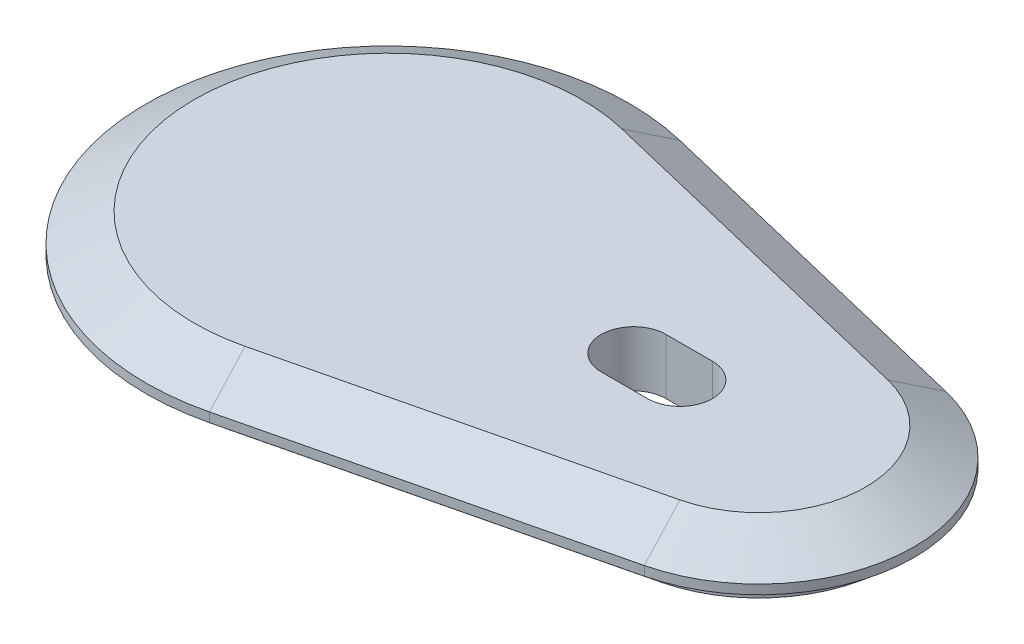
ISO-10303-21;
HEADER;
FILE_DESCRIPTION(('STEP AP214'),'2;1');
FILE_NAME('part.step','',(''),(''),'','','');
FILE_SCHEMA(('AUTOMOTIVE_DESIGN { 1 0 10303 214 1 1 1 1 }'));
ENDSEC;
DATA;
#1=APPLICATION_CONTEXT('core data for automotive mechanical design processes');
#2=APPLICATION_PROTOCOL_DEFINITION('international standard','automotive_design',2000,#1);
#3=PRODUCT_CONTEXT('',#1,'mechanical');
#4=PRODUCT('Part','Part','',(#3));
#5=PRODUCT_RELATED_PRODUCT_CATEGORY('part','',(#4));
#6=PRODUCT_DEFINITION_FORMATION('','',#4);
#7=PRODUCT_DEFINITION_CONTEXT('part definition',#1,'design');
#8=PRODUCT_DEFINITION('design','',#6,#7);
#9=PRODUCT_DEFINITION_SHAPE('','',#8);
#10=(LENGTH_UNIT() NAMED_UNIT(*) SI_UNIT(.MILLI.,.METRE.));
#11=(NAMED_UNIT(*) PLANE_ANGLE_UNIT() SI_UNIT($,.RADIAN.));
#12=(NAMED_UNIT(*) SI_UNIT($,.STERADIAN.) SOLID_ANGLE_UNIT());
#13=UNCERTAINTY_MEASURE_WITH_UNIT(LENGTH_MEASURE(1.E-05),#10,'distance_accuracy_value','');
#14=(GEOMETRIC_REPRESENTATION_CONTEXT(3) GLOBAL_UNCERTAINTY_ASSIGNED_CONTEXT((#13)) GLOBAL_UNIT_ASSIGNED_CONTEXT((#10,
#11,#12)) REPRESENTATION_CONTEXT('',''));
#15=CARTESIAN_POINT('',(0.,0.,0.));
#16=DIRECTION('',(0.,0.,1.));
#17=DIRECTION('',(1.,0.,0.));
#18=AXIS2_PLACEMENT_3D('',#15,#16,#17);
#19=CARTESIAN_POINT('',(0.,-1.,0.));
#20=DIRECTION('',(0.,1.,0.));
#21=DIRECTION('',(0.,0.,1.));
#22=AXIS2_PLACEMENT_3D('',#19,#20,#21);
#23=PLANE('',#22);
#24=CARTESIAN_POINT('',(0.,-1.,0.));
#25=DIRECTION('',(0.,1.,0.));
#26=DIRECTION('',(0.,0.,1.));
#27=AXIS2_PLACEMENT_3D('',#24,#25,#26);
#28=CIRCLE('',#27,26.1);
#29=CARTESIAN_POINT('',(6.113925,-1.,-25.3738038357353));
#30=VERTEX_POINT('',#29);
#31=CARTESIAN_POINT('',(6.113925,-1.,25.3738038357353));
#32=VERTEX_POINT('',#31);
#33=EDGE_CURVE('E220',#30,#32,#28,.T.);
#34=ORIENTED_EDGE('',*,*,#33,.F.);
#35=DIRECTION('',(-0.972176392173766,0.,-0.23425));
#36=VECTOR('',#35,1.);
#37=CARTESIAN_POINT('',(43.9190025,-1.,-16.2645110410671));
#38=LINE('',#37,#36);
#39=CARTESIAN_POINT('',(43.9190025,-1.,-16.2645110410671));
#40=VERTEX_POINT('',#39);
#41=EDGE_CURVE('E230',#40,#30,#38,.T.);
#42=ORIENTED_EDGE('',*,*,#41,.F.);
#43=CARTESIAN_POINT('',(40.,-1.,0.));
#44=DIRECTION('',(0.,1.,0.));
#45=DIRECTION('',(0.,0.,1.));
#46=AXIS2_PLACEMENT_3D('',#43,#44,#45);
#47=CIRCLE('',#46,16.73);
#48=CARTESIAN_POINT('',(43.9190025,-1.,16.2645110410671));
#49=VERTEX_POINT('',#48);
#50=EDGE_CURVE('E227',#49,#40,#47,.T.);
#51=ORIENTED_EDGE('',*,*,#50,.F.);
#52=DIRECTION('',(0.972176392173766,0.,-0.23425));
#53=VECTOR('',#52,1.);
#54=CARTESIAN_POINT('',(6.113925,-1.,25.3738038357353));
#55=LINE('',#54,#53);
#56=EDGE_CURVE('E223',#32,#49,#55,.T.);
#57=ORIENTED_EDGE('',*,*,#56,.F.);
#58=EDGE_LOOP('',(#34,#42,#51,#57));
#59=FACE_BOUND('',#58,.T.);
#60=DIRECTION('',(0.972176392173766,0.,0.23425));
#61=VECTOR('',#60,1.);
#62=CARTESIAN_POINT('',(5.551725,-1.,-23.0405804945182));
#63=LINE('',#62,#61);
#64=CARTESIAN_POINT('',(5.551725,-1.,-23.0405804945182));
#65=VERTEX_POINT('',#64);
#66=CARTESIAN_POINT('',(43.3568025,-1.,-13.9312876998501));
#67=VERTEX_POINT('',#66);
#68=EDGE_CURVE('E11',#65,#67,#63,.T.);
#69=ORIENTED_EDGE('',*,*,#68,.F.);
#70=CARTESIAN_POINT('',(0.,-1.,0.));
#71=DIRECTION('',(0.,1.,0.));
#72=DIRECTION('',(0.,0.,1.));
#73=AXIS2_PLACEMENT_3D('',#70,#71,#72);
#74=CIRCLE('',#73,23.7);
#75=CARTESIAN_POINT('',(5.551725,-1.,23.0405804945182));
#76=VERTEX_POINT('',#75);
#77=EDGE_CURVE('E247',#65,#76,#74,.T.);
#78=ORIENTED_EDGE('',*,*,#77,.T.);
#79=DIRECTION('',(0.972176392173766,0.,-0.23425));
#80=VECTOR('',#79,1.);
#81=CARTESIAN_POINT('',(5.551725,-1.,23.0405804945182));
#82=LINE('',#81,#80);
#83=CARTESIAN_POINT('',(43.3568025,-1.,13.9312876998501));
#84=VERTEX_POINT('',#83);
#85=EDGE_CURVE('E255',#76,#84,#82,.T.);
#86=ORIENTED_EDGE('',*,*,#85,.T.);
#87=CARTESIAN_POINT('',(40.,-1.,0.));
#88=DIRECTION('',(0.,1.,0.));
#89=DIRECTION('',(0.,0.,1.));
#90=AXIS2_PLACEMENT_3D('',#87,#88,#89);
#91=CIRCLE('',#90,14.33);
#92=EDGE_CURVE('E48',#84,#67,#91,.T.);
#93=ORIENTED_EDGE('',*,*,#92,.T.);
#94=EDGE_LOOP('',(#69,#78,#86,#93));
#95=FACE_BOUND('',#94,.T.);
#96=ADVANCED_FACE('F40',(#59,#95),#23,.F.);
#97=CARTESIAN_POINT('',(0.,-1.,0.));
#98=DIRECTION('',(0.,1.,0.));
#99=DIRECTION('',(0.,0.,1.));
#100=AXIS2_PLACEMENT_3D('',#97,#98,#99);
#101=CYLINDRICAL_SURFACE('',#100,26.1);
#102=CARTESIAN_POINT('',(0.,0.,0.));
#103=DIRECTION('',(0.,1.,0.));
#104=DIRECTION('',(0.,0.,1.));
#105=AXIS2_PLACEMENT_3D('',#102,#103,#104);
#106=CIRCLE('',#105,26.1);
#107=CARTESIAN_POINT('',(6.113925,0.,-25.3738038357353));
#108=VERTEX_POINT('',#107);
#109=CARTESIAN_POINT('',(6.113925,0.,25.3738038357353));
#110=VERTEX_POINT('',#109);
#111=EDGE_CURVE('E202',#108,#110,#106,.T.);
#112=ORIENTED_EDGE('',*,*,#111,.F.);
#113=DIRECTION('',(0.,1.,0.));
#114=VECTOR('',#113,1.);
#115=CARTESIAN_POINT('',(6.113925,-1.,-25.3738038357353));
#116=LINE('',#115,#114);
#117=EDGE_CURVE('E244',#30,#108,#116,.T.);
#118=ORIENTED_EDGE('',*,*,#117,.F.);
#119=ORIENTED_EDGE('',*,*,#33,.T.);
#120=DIRECTION('',(0.,1.,0.));
#121=VECTOR('',#120,1.);
#122=CARTESIAN_POINT('',(6.113925,-1.,25.3738038357353));
#123=LINE('',#122,#121);
#124=EDGE_CURVE('E233',#32,#110,#123,.T.);
#125=ORIENTED_EDGE('',*,*,#124,.T.);
#126=EDGE_LOOP('',(#112,#118,#119,#125));
#127=FACE_BOUND('',#126,.T.);
#128=ADVANCED_FACE('F42',(#127),#101,.T.);
#129=CARTESIAN_POINT('',(43.9190025,-1.,-16.2645110410671));
#130=DIRECTION('',(0.23425,0.,-0.972176392173766));
#131=DIRECTION('',(-0.972176392173766,0.,-0.23425));
#132=AXIS2_PLACEMENT_3D('',#129,#130,#131);
#133=PLANE('',#132);
#134=DIRECTION('',(-0.972176392173766,0.,-0.23425));
#135=VECTOR('',#134,1.);
#136=CARTESIAN_POINT('',(43.9190025,0.,-16.2645110410671));
#137=LINE('',#136,#135);
#138=CARTESIAN_POINT('',(43.9190025,0.,-16.2645110410671));
#139=VERTEX_POINT('',#138);
#140=EDGE_CURVE('E224',#139,#108,#137,.T.);
#141=ORIENTED_EDGE('',*,*,#140,.F.);
#142=DIRECTION('',(0.,1.,0.));
#143=VECTOR('',#142,1.);
#144=CARTESIAN_POINT('',(43.9190025,-1.,-16.2645110410671));
#145=LINE('',#144,#143);
#146=EDGE_CURVE('E248',#40,#139,#145,.T.);
#147=ORIENTED_EDGE('',*,*,#146,.F.);
#148=ORIENTED_EDGE('',*,*,#41,.T.);
#149=ORIENTED_EDGE('',*,*,#117,.T.);
#150=EDGE_LOOP('',(#141,#147,#148,#149));
#151=FACE_BOUND('',#150,.T.);
#152=ADVANCED_FACE('F290',(#151),#133,.T.);
#153=CARTESIAN_POINT('',(40.,-1.,0.));
#154=DIRECTION('',(0.,1.,0.));
#155=DIRECTION('',(0.,0.,1.));
#156=AXIS2_PLACEMENT_3D('',#153,#154,#155);
#157=CYLINDRICAL_SURFACE('',#156,16.73);
#158=CARTESIAN_POINT('',(40.,0.,0.));
#159=DIRECTION('',(0.,1.,0.));
#160=DIRECTION('',(0.,0.,1.));
#161=AXIS2_PLACEMENT_3D('',#158,#159,#160);
#162=CIRCLE('',#161,16.73);
#163=CARTESIAN_POINT('',(43.9190025,0.,16.2645110410671));
#164=VERTEX_POINT('',#163);
#165=EDGE_CURVE('E239',#164,#139,#162,.T.);
#166=ORIENTED_EDGE('',*,*,#165,.F.);
#167=DIRECTION('',(0.,1.,0.));
#168=VECTOR('',#167,1.);
#169=CARTESIAN_POINT('',(43.9190025,-1.,16.2645110410671));
#170=LINE('',#169,#168);
#171=EDGE_CURVE('E250',#49,#164,#170,.T.);
#172=ORIENTED_EDGE('',*,*,#171,.F.);
#173=ORIENTED_EDGE('',*,*,#50,.T.);
#174=ORIENTED_EDGE('',*,*,#146,.T.);
#175=EDGE_LOOP('',(#166,#172,#173,#174));
#176=FACE_BOUND('',#175,.T.);
#177=ADVANCED_FACE('F299',(#176),#157,.T.);
#178=CARTESIAN_POINT('',(6.113925,-1.,25.3738038357353));
#179=DIRECTION('',(0.23425,0.,0.972176392173766));
#180=DIRECTION('',(0.972176392173766,0.,-0.23425));
#181=AXIS2_PLACEMENT_3D('',#178,#179,#180);
#182=PLANE('',#181);
#183=DIRECTION('',(0.972176392173766,0.,-0.23425));
#184=VECTOR('',#183,1.);
#185=CARTESIAN_POINT('',(6.113925,0.,25.3738038357353));
#186=LINE('',#185,#184);
#187=EDGE_CURVE('E236',#110,#164,#186,.T.);
#188=ORIENTED_EDGE('',*,*,#187,.F.);
#189=ORIENTED_EDGE('',*,*,#124,.F.);
#190=ORIENTED_EDGE('',*,*,#56,.T.);
#191=ORIENTED_EDGE('',*,*,#171,.T.);
#192=EDGE_LOOP('',(#188,#189,#190,#191));
#193=FACE_BOUND('',#192,.T.);
#194=ADVANCED_FACE('F302',(#193),#182,.T.);
#195=CARTESIAN_POINT('',(0.,0.,0.));
#196=DIRECTION('',(0.,-1.,0.));
#197=DIRECTION('',(0.,0.,1.));
#198=AXIS2_PLACEMENT_3D('',#195,#196,#197);
#199=CONICAL_SURFACE('',#198,26.1,1.0471975511966);
#200=ORIENTED_EDGE('',*,*,#111,.T.);
#201=DIRECTION('',(0.202866450836505,-0.499999999999998,0.841929452581986));
#202=VECTOR('',#201,1.);
#203=CARTESIAN_POINT('',(6.113925,0.,25.3738038357353));
#204=LINE('',#203,#202);
#205=CARTESIAN_POINT('',(4.89672629498096,3.,20.3222271202433));
#206=VERTEX_POINT('',#205);
#207=EDGE_CURVE('E199',#206,#110,#204,.T.);
#208=ORIENTED_EDGE('',*,*,#207,.F.);
#209=CARTESIAN_POINT('',(0.,3.,0.));
#210=DIRECTION('',(0.,1.,0.));
#211=DIRECTION('',(0.,0.,1.));
#212=AXIS2_PLACEMENT_3D('',#209,#210,#211);
#213=CIRCLE('',#212,20.9038475772933);
#214=CARTESIAN_POINT('',(4.89672629498095,3.,-20.3222271202434));
#215=VERTEX_POINT('',#214);
#216=EDGE_CURVE('E191',#215,#206,#213,.T.);
#217=ORIENTED_EDGE('',*,*,#216,.F.);
#218=DIRECTION('',(0.202866450836505,-0.499999999999998,-0.841929452581986));
#219=VECTOR('',#218,1.);
#220=CARTESIAN_POINT('',(6.11392499999999,0.,-25.3738038357353));
#221=LINE('',#220,#219);
#222=EDGE_CURVE('E204',#215,#108,#221,.T.);
#223=ORIENTED_EDGE('',*,*,#222,.T.);
#224=EDGE_LOOP('',(#200,#208,#217,#223));
#225=FACE_BOUND('',#224,.T.);
#226=ADVANCED_FACE('F305',(#225),#199,.T.);
#227=CARTESIAN_POINT('',(6.113925,0.,25.3738038357353));
#228=DIRECTION('',(0.117124999999999,0.86602540378444,0.486088196086881));
#229=DIRECTION('',(0.,-0.489457040507627,0.872027410978299));
#230=AXIS2_PLACEMENT_3D('',#227,#228,#229);
#231=PLANE('',#230);
#232=ORIENTED_EDGE('',*,*,#187,.T.);
#233=DIRECTION('',(0.202866450836506,-0.499999999999998,0.841929452581985));
#234=VECTOR('',#233,1.);
#235=CARTESIAN_POINT('',(43.9190025,0.,16.2645110410671));
#236=LINE('',#235,#234);
#237=CARTESIAN_POINT('',(42.701803794981,3.,11.2129343255752));
#238=VERTEX_POINT('',#237);
#239=EDGE_CURVE('E203',#238,#164,#236,.T.);
#240=ORIENTED_EDGE('',*,*,#239,.F.);
#241=DIRECTION('',(-0.972176392173766,0.,0.23425));
#242=VECTOR('',#241,1.);
#243=CARTESIAN_POINT('',(4.89672629498096,3.,20.3222271202433));
#244=LINE('',#243,#242);
#245=EDGE_CURVE('E215',#206,#238,#244,.F.);
#246=ORIENTED_EDGE('',*,*,#245,.F.);
#247=ORIENTED_EDGE('',*,*,#207,.T.);
#248=EDGE_LOOP('',(#232,#240,#246,#247));
#249=FACE_BOUND('',#248,.T.);
#250=ADVANCED_FACE('F295',(#249),#231,.T.);
#251=CARTESIAN_POINT('',(40.,0.,0.));
#252=DIRECTION('',(0.,-1.,0.));
#253=DIRECTION('',(0.,0.,1.));
#254=AXIS2_PLACEMENT_3D('',#251,#252,#253);
#255=CONICAL_SURFACE('',#254,16.73,1.0471975511966);
#256=ORIENTED_EDGE('',*,*,#165,.T.);
#257=DIRECTION('',(0.202866450836505,-0.499999999999998,-0.841929452581986));
#258=VECTOR('',#257,1.);
#259=CARTESIAN_POINT('',(43.9190025,0.,-16.2645110410671));
#260=LINE('',#259,#258);
#261=CARTESIAN_POINT('',(42.701803794981,3.,-11.2129343255752));
#262=VERTEX_POINT('',#261);
#263=EDGE_CURVE('E207',#262,#139,#260,.T.);
#264=ORIENTED_EDGE('',*,*,#263,.F.);
#265=CARTESIAN_POINT('',(40.,3.,0.));
#266=DIRECTION('',(0.,1.,0.));
#267=DIRECTION('',(0.,0.,1.));
#268=AXIS2_PLACEMENT_3D('',#265,#266,#267);
#269=CIRCLE('',#268,11.5338475772933);
#270=EDGE_CURVE('E217',#238,#262,#269,.T.);
#271=ORIENTED_EDGE('',*,*,#270,.F.);
#272=ORIENTED_EDGE('',*,*,#239,.T.);
#273=EDGE_LOOP('',(#256,#264,#271,#272));
#274=FACE_BOUND('',#273,.T.);
#275=ADVANCED_FACE('F328',(#274),#255,.T.);
#276=CARTESIAN_POINT('',(43.9190025,0.,-16.2645110410671));
#277=DIRECTION('',(0.117124999999999,0.86602540378444,-0.486088196086881));
#278=DIRECTION('',(0.,0.489457040507627,0.872027410978299));
#279=AXIS2_PLACEMENT_3D('',#276,#277,#278);
#280=PLANE('',#279);
#281=ORIENTED_EDGE('',*,*,#140,.T.);
#282=ORIENTED_EDGE('',*,*,#222,.F.);
#283=DIRECTION('',(0.972176392173766,0.,0.23425));
#284=VECTOR('',#283,1.);
#285=CARTESIAN_POINT('',(42.701803794981,3.,-11.2129343255752));
#286=LINE('',#285,#284);
#287=EDGE_CURVE('E208',#262,#215,#286,.F.);
#288=ORIENTED_EDGE('',*,*,#287,.F.);
#289=ORIENTED_EDGE('',*,*,#263,.T.);
#290=EDGE_LOOP('',(#281,#282,#288,#289));
#291=FACE_BOUND('',#290,.T.);
#292=ADVANCED_FACE('F323',(#291),#280,.T.);
#293=CARTESIAN_POINT('',(0.,3.,0.));
#294=DIRECTION('',(0.,1.,0.));
#295=DIRECTION('',(0.,0.,1.));
#296=AXIS2_PLACEMENT_3D('',#293,#294,#295);
#297=PLANE('',#296);
#298=CARTESIAN_POINT('',(31.5000000000004,3.,0.));
#299=DIRECTION('',(0.,1.,0.));
#300=DIRECTION('',(0.,0.,1.));
#301=AXIS2_PLACEMENT_3D('',#298,#299,#300);
#302=CIRCLE('',#301,3.5);
#303=CARTESIAN_POINT('',(31.5000000000004,3.,3.5));
#304=VERTEX_POINT('',#303);
#305=CARTESIAN_POINT('',(31.5000000000004,3.,-3.5));
#306=VERTEX_POINT('',#305);
#307=EDGE_CURVE('E55',#304,#306,#302,.T.);
#308=ORIENTED_EDGE('',*,*,#307,.F.);
#309=DIRECTION('',(1.,0.,0.));
#310=VECTOR('',#309,1.);
#311=CARTESIAN_POINT('',(31.5000000000004,3.,3.5));
#312=LINE('',#311,#310);
#313=CARTESIAN_POINT('',(26.5000000000004,3.,3.5));
#314=VERTEX_POINT('',#313);
#315=EDGE_CURVE('E158',#314,#304,#312,.T.);
#316=ORIENTED_EDGE('',*,*,#315,.F.);
#317=CARTESIAN_POINT('',(26.5000000000004,3.,0.));
#318=DIRECTION('',(0.,1.,0.));
#319=DIRECTION('',(0.,0.,1.));
#320=AXIS2_PLACEMENT_3D('',#317,#318,#319);
#321=CIRCLE('',#320,3.5);
#322=CARTESIAN_POINT('',(26.5000000000004,3.,-3.5));
#323=VERTEX_POINT('',#322);
#324=EDGE_CURVE('E161',#323,#314,#321,.T.);
#325=ORIENTED_EDGE('',*,*,#324,.F.);
#326=DIRECTION('',(-1.,0.,0.));
#327=VECTOR('',#326,1.);
#328=CARTESIAN_POINT('',(31.5000000000004,3.,-3.5));
#329=LINE('',#328,#327);
#330=EDGE_CURVE('E167',#306,#323,#329,.T.);
#331=ORIENTED_EDGE('',*,*,#330,.F.);
#332=EDGE_LOOP('',(#308,#316,#325,#331));
#333=FACE_BOUND('',#332,.T.);
#334=ORIENTED_EDGE('',*,*,#216,.T.);
#335=ORIENTED_EDGE('',*,*,#245,.T.);
#336=ORIENTED_EDGE('',*,*,#270,.T.);
#337=ORIENTED_EDGE('',*,*,#287,.T.);
#338=EDGE_LOOP('',(#334,#335,#336,#337));
#339=FACE_BOUND('',#338,.T.);
#340=ADVANCED_FACE('F331',(#333,#339),#297,.T.);
#341=CARTESIAN_POINT('',(5.551725,-3.,-23.0405804945182));
#342=DIRECTION('',(-0.23425,0.,0.972176392173766));
#343=DIRECTION('',(0.972176392173766,0.,0.23425));
#344=AXIS2_PLACEMENT_3D('',#341,#342,#343);
#345=PLANE('',#344);
#346=DIRECTION('',(0.,1.,0.));
#347=VECTOR('',#346,1.);
#348=CARTESIAN_POINT('',(5.551725,-3.,-23.0405804945182));
#349=LINE('',#348,#347);
#350=CARTESIAN_POINT('',(5.551725,-3.,-23.0405804945182));
#351=VERTEX_POINT('',#350);
#352=EDGE_CURVE('E187',#351,#65,#349,.T.);
#353=ORIENTED_EDGE('',*,*,#352,.T.);
#354=ORIENTED_EDGE('',*,*,#68,.T.);
#355=DIRECTION('',(0.,1.,0.));
#356=VECTOR('',#355,1.);
#357=CARTESIAN_POINT('',(43.3568025,-3.,-13.9312876998501));
#358=LINE('',#357,#356);
#359=CARTESIAN_POINT('',(43.3568025,-3.,-13.9312876998501));
#360=VERTEX_POINT('',#359);
#361=EDGE_CURVE('E188',#360,#67,#358,.T.);
#362=ORIENTED_EDGE('',*,*,#361,.F.);
#363=DIRECTION('',(0.972176392173766,0.,0.23425));
#364=VECTOR('',#363,1.);
#365=CARTESIAN_POINT('',(5.551725,-3.,-23.0405804945182));
#366=LINE('',#365,#364);
#367=EDGE_CURVE('E173',#351,#360,#366,.T.);
#368=ORIENTED_EDGE('',*,*,#367,.F.);
#369=EDGE_LOOP('',(#353,#354,#362,#368));
#370=FACE_BOUND('',#369,.T.);
#371=ADVANCED_FACE('F271',(#370),#345,.F.);
#372=CARTESIAN_POINT('',(40.,-3.,0.));
#373=DIRECTION('',(0.,1.,0.));
#374=DIRECTION('',(0.,0.,1.));
#375=AXIS2_PLACEMENT_3D('',#372,#373,#374);
#376=CYLINDRICAL_SURFACE('',#375,14.33);
#377=ORIENTED_EDGE('',*,*,#92,.F.);
#378=DIRECTION('',(0.,1.,0.));
#379=VECTOR('',#378,1.);
#380=CARTESIAN_POINT('',(43.3568025,-3.,13.9312876998501));
#381=LINE('',#380,#379);
#382=CARTESIAN_POINT('',(43.3568025,-3.,13.9312876998501));
#383=VERTEX_POINT('',#382);
#384=EDGE_CURVE('E192',#383,#84,#381,.T.);
#385=ORIENTED_EDGE('',*,*,#384,.F.);
#386=CARTESIAN_POINT('',(40.,-3.,0.));
#387=DIRECTION('',(0.,1.,0.));
#388=DIRECTION('',(0.,0.,1.));
#389=AXIS2_PLACEMENT_3D('',#386,#387,#388);
#390=CIRCLE('',#389,14.33);
#391=EDGE_CURVE('E184',#383,#360,#390,.T.);
#392=ORIENTED_EDGE('',*,*,#391,.T.);
#393=ORIENTED_EDGE('',*,*,#361,.T.);
#394=EDGE_LOOP('',(#377,#385,#392,#393));
#395=FACE_BOUND('',#394,.T.);
#396=ADVANCED_FACE('F262',(#395),#376,.T.);
#397=CARTESIAN_POINT('',(5.551725,-3.,23.0405804945182));
#398=DIRECTION('',(0.23425,0.,0.972176392173766));
#399=DIRECTION('',(0.972176392173766,0.,-0.23425));
#400=AXIS2_PLACEMENT_3D('',#397,#398,#399);
#401=PLANE('',#400);
#402=ORIENTED_EDGE('',*,*,#85,.F.);
#403=DIRECTION('',(0.,1.,0.));
#404=VECTOR('',#403,1.);
#405=CARTESIAN_POINT('',(5.551725,-3.,23.0405804945182));
#406=LINE('',#405,#404);
#407=CARTESIAN_POINT('',(5.551725,-3.,23.0405804945182));
#408=VERTEX_POINT('',#407);
#409=EDGE_CURVE('E195',#408,#76,#406,.T.);
#410=ORIENTED_EDGE('',*,*,#409,.F.);
#411=DIRECTION('',(0.972176392173766,0.,-0.23425));
#412=VECTOR('',#411,1.);
#413=CARTESIAN_POINT('',(5.551725,-3.,23.0405804945182));
#414=LINE('',#413,#412);
#415=EDGE_CURVE('E181',#408,#383,#414,.T.);
#416=ORIENTED_EDGE('',*,*,#415,.T.);
#417=ORIENTED_EDGE('',*,*,#384,.T.);
#418=EDGE_LOOP('',(#402,#410,#416,#417));
#419=FACE_BOUND('',#418,.T.);
#420=ADVANCED_FACE('F265',(#419),#401,.T.);
#421=CARTESIAN_POINT('',(0.,-3.,0.));
#422=DIRECTION('',(0.,1.,0.));
#423=DIRECTION('',(0.,0.,1.));
#424=AXIS2_PLACEMENT_3D('',#421,#422,#423);
#425=CYLINDRICAL_SURFACE('',#424,23.7);
#426=ORIENTED_EDGE('',*,*,#77,.F.);
#427=ORIENTED_EDGE('',*,*,#352,.F.);
#428=CARTESIAN_POINT('',(0.,-3.,0.));
#429=DIRECTION('',(0.,1.,0.));
#430=DIRECTION('',(0.,0.,1.));
#431=AXIS2_PLACEMENT_3D('',#428,#429,#430);
#432=CIRCLE('',#431,23.7);
#433=EDGE_CURVE('E178',#351,#408,#432,.T.);
#434=ORIENTED_EDGE('',*,*,#433,.T.);
#435=ORIENTED_EDGE('',*,*,#409,.T.);
#436=EDGE_LOOP('',(#426,#427,#434,#435));
#437=FACE_BOUND('',#436,.T.);
#438=ADVANCED_FACE('F273',(#437),#425,.T.);
#439=CARTESIAN_POINT('',(0.,-3.,0.));
#440=DIRECTION('',(0.,1.,0.));
#441=DIRECTION('',(0.,0.,1.));
#442=AXIS2_PLACEMENT_3D('',#439,#440,#441);
#443=PLANE('',#442);
#444=DIRECTION('',(1.,0.,0.));
#445=VECTOR('',#444,1.);
#446=CARTESIAN_POINT('',(31.5000000000004,-3.,3.5));
#447=LINE('',#446,#445);
#448=CARTESIAN_POINT('',(26.5000000000004,-3.,3.5));
#449=VERTEX_POINT('',#448);
#450=CARTESIAN_POINT('',(31.5000000000004,-3.,3.5));
#451=VERTEX_POINT('',#450);
#452=EDGE_CURVE('E148',#449,#451,#447,.T.);
#453=ORIENTED_EDGE('',*,*,#452,.T.);
#454=CARTESIAN_POINT('',(31.5000000000004,-3.,0.));
#455=DIRECTION('',(0.,1.,0.));
#456=DIRECTION('',(0.,0.,1.));
#457=AXIS2_PLACEMENT_3D('',#454,#455,#456);
#458=CIRCLE('',#457,3.5);
#459=CARTESIAN_POINT('',(31.5000000000004,-3.,-3.5));
#460=VERTEX_POINT('',#459);
#461=EDGE_CURVE('E142',#451,#460,#458,.T.);
#462=ORIENTED_EDGE('',*,*,#461,.T.);
#463=DIRECTION('',(-1.,0.,0.));
#464=VECTOR('',#463,1.);
#465=CARTESIAN_POINT('',(31.5000000000004,-3.,-3.5));
#466=LINE('',#465,#464);
#467=CARTESIAN_POINT('',(26.5000000000004,-3.,-3.5));
#468=VERTEX_POINT('',#467);
#469=EDGE_CURVE('E151',#460,#468,#466,.T.);
#470=ORIENTED_EDGE('',*,*,#469,.T.);
#471=CARTESIAN_POINT('',(26.5000000000004,-3.,0.));
#472=DIRECTION('',(0.,1.,0.));
#473=DIRECTION('',(0.,0.,1.));
#474=AXIS2_PLACEMENT_3D('',#471,#472,#473);
#475=CIRCLE('',#474,3.5);
#476=EDGE_CURVE('E63',#468,#449,#475,.T.);
#477=ORIENTED_EDGE('',*,*,#476,.T.);
#478=EDGE_LOOP('',(#453,#462,#470,#477));
#479=FACE_BOUND('',#478,.T.);
#480=ORIENTED_EDGE('',*,*,#367,.T.);
#481=ORIENTED_EDGE('',*,*,#391,.F.);
#482=ORIENTED_EDGE('',*,*,#415,.F.);
#483=ORIENTED_EDGE('',*,*,#433,.F.);
#484=EDGE_LOOP('',(#480,#481,#482,#483));
#485=FACE_BOUND('',#484,.T.);
#486=ADVANCED_FACE('F155',(#479,#485),#443,.F.);
#487=CARTESIAN_POINT('',(31.5000000000004,-3.,0.));
#488=DIRECTION('',(0.,1.,0.));
#489=DIRECTION('',(0.,0.,1.));
#490=AXIS2_PLACEMENT_3D('',#487,#488,#489);
#491=CYLINDRICAL_SURFACE('',#490,3.5);
#492=ORIENTED_EDGE('',*,*,#307,.T.);
#493=DIRECTION('',(0.,1.,0.));
#494=VECTOR('',#493,1.);
#495=CARTESIAN_POINT('',(31.5000000000004,-3.,-3.5));
#496=LINE('',#495,#494);
#497=EDGE_CURVE('E138',#460,#306,#496,.T.);
#498=ORIENTED_EDGE('',*,*,#497,.F.);
#499=ORIENTED_EDGE('',*,*,#461,.F.);
#500=DIRECTION('',(0.,1.,0.));
#501=VECTOR('',#500,1.);
#502=CARTESIAN_POINT('',(31.5000000000004,-3.,3.5));
#503=LINE('',#502,#501);
#504=EDGE_CURVE('E171',#451,#304,#503,.T.);
#505=ORIENTED_EDGE('',*,*,#504,.T.);
#506=EDGE_LOOP('',(#492,#498,#499,#505));
#507=FACE_BOUND('',#506,.T.);
#508=ADVANCED_FACE('F140',(#507),#491,.F.);
#509=CARTESIAN_POINT('',(31.5000000000004,-3.,3.5));
#510=DIRECTION('',(0.,0.,1.));
#511=DIRECTION('',(1.,0.,0.));
#512=AXIS2_PLACEMENT_3D('',#509,#510,#511);
#513=PLANE('',#512);
#514=ORIENTED_EDGE('',*,*,#315,.T.);
#515=ORIENTED_EDGE('',*,*,#504,.F.);
#516=ORIENTED_EDGE('',*,*,#452,.F.);
#517=DIRECTION('',(0.,1.,0.));
#518=VECTOR('',#517,1.);
#519=CARTESIAN_POINT('',(26.5000000000004,-3.,3.5));
#520=LINE('',#519,#518);
#521=EDGE_CURVE('E174',#449,#314,#520,.T.);
#522=ORIENTED_EDGE('',*,*,#521,.T.);
#523=EDGE_LOOP('',(#514,#515,#516,#522));
#524=FACE_BOUND('',#523,.T.);
#525=ADVANCED_FACE('F438',(#524),#513,.F.);
#526=CARTESIAN_POINT('',(26.5000000000004,-3.,0.));
#527=DIRECTION('',(0.,1.,0.));
#528=DIRECTION('',(0.,0.,1.));
#529=AXIS2_PLACEMENT_3D('',#526,#527,#528);
#530=CYLINDRICAL_SURFACE('',#529,3.5);
#531=ORIENTED_EDGE('',*,*,#324,.T.);
#532=ORIENTED_EDGE('',*,*,#521,.F.);
#533=ORIENTED_EDGE('',*,*,#476,.F.);
#534=DIRECTION('',(0.,1.,0.));
#535=VECTOR('',#534,1.);
#536=CARTESIAN_POINT('',(26.5000000000004,-3.,-3.5));
#537=LINE('',#536,#535);
#538=EDGE_CURVE('E147',#468,#323,#537,.T.);
#539=ORIENTED_EDGE('',*,*,#538,.T.);
#540=EDGE_LOOP('',(#531,#532,#533,#539));
#541=FACE_BOUND('',#540,.T.);
#542=ADVANCED_FACE('F446',(#541),#530,.F.);
#543=CARTESIAN_POINT('',(31.5000000000004,-3.,-3.5));
#544=DIRECTION('',(0.,0.,-1.));
#545=DIRECTION('',(-1.,0.,0.));
#546=AXIS2_PLACEMENT_3D('',#543,#544,#545);
#547=PLANE('',#546);
#548=ORIENTED_EDGE('',*,*,#330,.T.);
#549=ORIENTED_EDGE('',*,*,#538,.F.);
#550=ORIENTED_EDGE('',*,*,#469,.F.);
#551=ORIENTED_EDGE('',*,*,#497,.T.);
#552=EDGE_LOOP('',(#548,#549,#550,#551));
#553=FACE_BOUND('',#552,.T.);
#554=ADVANCED_FACE('F152',(#553),#547,.F.);
#555=CLOSED_SHELL('',(#96,#128,#152,#177,#194,#226,#250,#275,#292,#340,#371,#396,#420,#438,#486,
#508,#525,#542,#554));
#556=MANIFOLD_SOLID_BREP('B2',#555);
#557=ADVANCED_BREP_SHAPE_REPRESENTATION('',(#18,#556),#14);
#558=SHAPE_DEFINITION_REPRESENTATION(#9,#557);
ENDSEC;
END-ISO-10303-21;
